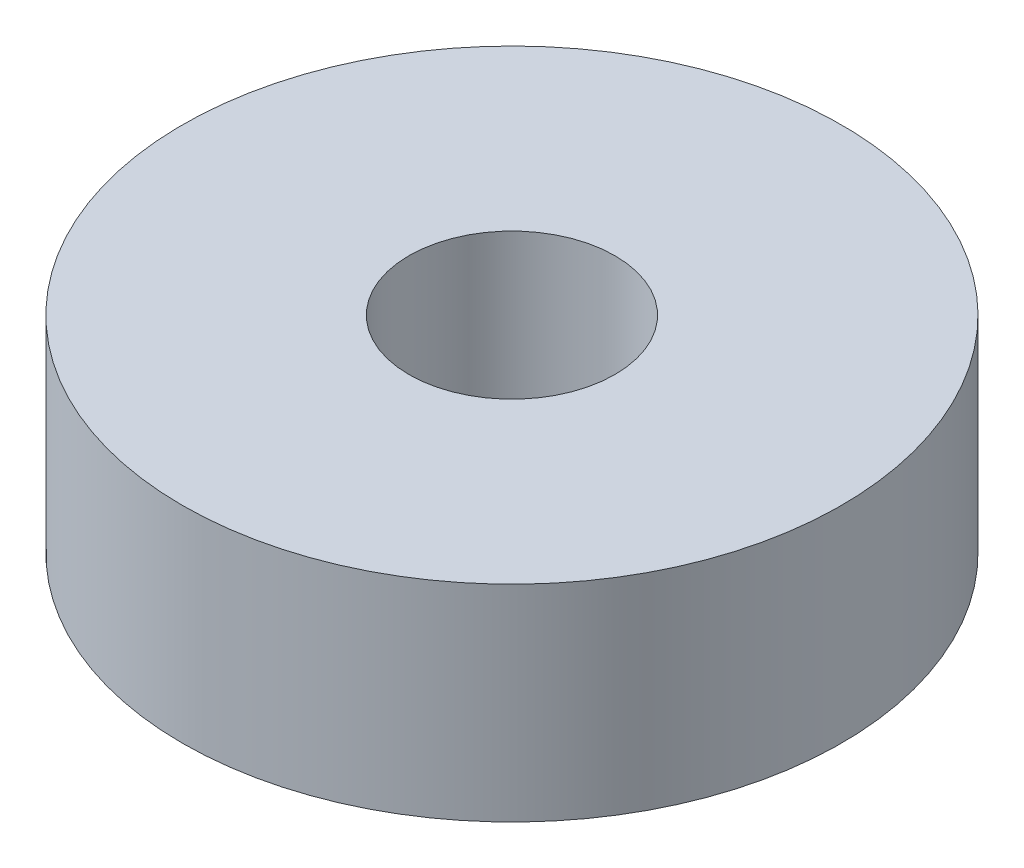
ISO-10303-21;
HEADER;
FILE_DESCRIPTION(('STEP AP214'),'2;1');
FILE_NAME('part.step','',(''),(''),'','','');
FILE_SCHEMA(('AUTOMOTIVE_DESIGN { 1 0 10303 214 1 1 1 1 }'));
ENDSEC;
DATA;
#1=APPLICATION_CONTEXT('core data for automotive mechanical design processes');
#2=APPLICATION_PROTOCOL_DEFINITION('international standard','automotive_design',2000,#1);
#3=PRODUCT_CONTEXT('',#1,'mechanical');
#4=PRODUCT('Part','Part','',(#3));
#5=PRODUCT_RELATED_PRODUCT_CATEGORY('part','',(#4));
#6=PRODUCT_DEFINITION_FORMATION('','',#4);
#7=PRODUCT_DEFINITION_CONTEXT('part definition',#1,'design');
#8=PRODUCT_DEFINITION('design','',#6,#7);
#9=PRODUCT_DEFINITION_SHAPE('','',#8);
#10=(LENGTH_UNIT() NAMED_UNIT(*) SI_UNIT(.MILLI.,.METRE.));
#11=(NAMED_UNIT(*) PLANE_ANGLE_UNIT() SI_UNIT($,.RADIAN.));
#12=(NAMED_UNIT(*) SI_UNIT($,.STERADIAN.) SOLID_ANGLE_UNIT());
#13=UNCERTAINTY_MEASURE_WITH_UNIT(LENGTH_MEASURE(1.E-05),#10,'distance_accuracy_value','');
#14=(GEOMETRIC_REPRESENTATION_CONTEXT(3) GLOBAL_UNCERTAINTY_ASSIGNED_CONTEXT((#13)) GLOBAL_UNIT_ASSIGNED_CONTEXT((#10,
#11,#12)) REPRESENTATION_CONTEXT('',''));
#15=CARTESIAN_POINT('',(0.,0.,0.));
#16=DIRECTION('',(0.,0.,1.));
#17=DIRECTION('',(1.,0.,0.));
#18=AXIS2_PLACEMENT_3D('',#15,#16,#17);
#19=CARTESIAN_POINT('',(0.,5.,0.));
#20=DIRECTION('',(0.,1.,0.));
#21=DIRECTION('',(0.,0.,1.));
#22=AXIS2_PLACEMENT_3D('',#19,#20,#21);
#23=PLANE('',#22);
#24=CARTESIAN_POINT('',(0.,5.,0.));
#25=DIRECTION('',(0.,1.,0.));
#26=DIRECTION('',(0.,0.,1.));
#27=AXIS2_PLACEMENT_3D('',#24,#25,#26);
#28=CIRCLE('',#27,8.);
#29=CARTESIAN_POINT('',(0.,5.,8.));
#30=VERTEX_POINT('',#29);
#31=EDGE_CURVE('E10',#30,#30,#28,.T.);
#32=ORIENTED_EDGE('',*,*,#31,.T.);
#33=EDGE_LOOP('',(#32));
#34=FACE_BOUND('',#33,.T.);
#35=CARTESIAN_POINT('',(0.,5.,0.));
#36=DIRECTION('',(0.,1.,0.));
#37=DIRECTION('',(0.,0.,1.));
#38=AXIS2_PLACEMENT_3D('',#35,#36,#37);
#39=CIRCLE('',#38,2.5);
#40=CARTESIAN_POINT('',(0.,5.,2.5));
#41=VERTEX_POINT('',#40);
#42=EDGE_CURVE('E41',#41,#41,#39,.T.);
#43=ORIENTED_EDGE('',*,*,#42,.F.);
#44=EDGE_LOOP('',(#43));
#45=FACE_BOUND('',#44,.T.);
#46=ADVANCED_FACE('F30',(#34,#45),#23,.T.);
#47=CARTESIAN_POINT('',(0.,0.,0.));
#48=DIRECTION('',(0.,1.,0.));
#49=DIRECTION('',(0.,0.,1.));
#50=AXIS2_PLACEMENT_3D('',#47,#48,#49);
#51=PLANE('',#50);
#52=CARTESIAN_POINT('',(0.,0.,0.));
#53=DIRECTION('',(0.,1.,0.));
#54=DIRECTION('',(0.,0.,1.));
#55=AXIS2_PLACEMENT_3D('',#52,#53,#54);
#56=CIRCLE('',#55,8.);
#57=CARTESIAN_POINT('',(0.,0.,8.));
#58=VERTEX_POINT('',#57);
#59=EDGE_CURVE('E34',#58,#58,#56,.T.);
#60=ORIENTED_EDGE('',*,*,#59,.F.);
#61=EDGE_LOOP('',(#60));
#62=FACE_BOUND('',#61,.T.);
#63=CARTESIAN_POINT('',(0.,0.,0.));
#64=DIRECTION('',(0.,1.,0.));
#65=DIRECTION('',(0.,0.,1.));
#66=AXIS2_PLACEMENT_3D('',#63,#64,#65);
#67=CIRCLE('',#66,2.5);
#68=CARTESIAN_POINT('',(0.,0.,2.5));
#69=VERTEX_POINT('',#68);
#70=EDGE_CURVE('E43',#69,#69,#67,.T.);
#71=ORIENTED_EDGE('',*,*,#70,.T.);
#72=EDGE_LOOP('',(#71));
#73=FACE_BOUND('',#72,.T.);
#74=ADVANCED_FACE('F53',(#62,#73),#51,.F.);
#75=CARTESIAN_POINT('',(0.,5.,0.));
#76=DIRECTION('',(0.,-1.,0.));
#77=DIRECTION('',(0.,0.,-1.));
#78=AXIS2_PLACEMENT_3D('',#75,#76,#77);
#79=CYLINDRICAL_SURFACE('',#78,8.);
#80=ORIENTED_EDGE('',*,*,#31,.F.);
#81=EDGE_LOOP('',(#80));
#82=FACE_BOUND('',#81,.T.);
#83=ORIENTED_EDGE('',*,*,#59,.T.);
#84=EDGE_LOOP('',(#83));
#85=FACE_BOUND('',#84,.T.);
#86=ADVANCED_FACE('F32',(#82,#85),#79,.T.);
#87=CARTESIAN_POINT('',(0.,5.,0.));
#88=DIRECTION('',(0.,-1.,0.));
#89=DIRECTION('',(0.,0.,-1.));
#90=AXIS2_PLACEMENT_3D('',#87,#88,#89);
#91=CYLINDRICAL_SURFACE('',#90,2.5);
#92=ORIENTED_EDGE('',*,*,#42,.T.);
#93=EDGE_LOOP('',(#92));
#94=FACE_BOUND('',#93,.T.);
#95=ORIENTED_EDGE('',*,*,#70,.F.);
#96=EDGE_LOOP('',(#95));
#97=FACE_BOUND('',#96,.T.);
#98=ADVANCED_FACE('F49',(#94,#97),#91,.F.);
#99=CLOSED_SHELL('',(#46,#74,#86,#98));
#100=MANIFOLD_SOLID_BREP('B2',#99);
#101=ADVANCED_BREP_SHAPE_REPRESENTATION('',(#18,#100),#14);
#102=SHAPE_DEFINITION_REPRESENTATION(#9,#101);
ENDSEC;
END-ISO-10303-21;
